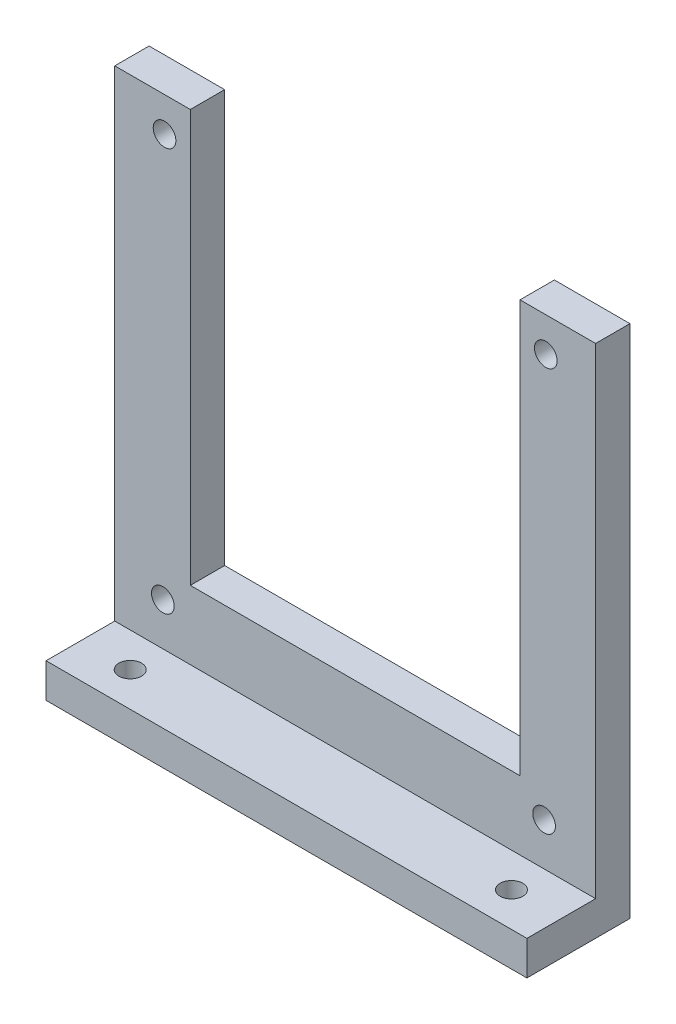
ISO-10303-21;
HEADER;
FILE_DESCRIPTION(('STEP AP214'),'2;1');
FILE_NAME('part.step','',(''),(''),'','','');
FILE_SCHEMA(('AUTOMOTIVE_DESIGN { 1 0 10303 214 1 1 1 1 }'));
ENDSEC;
DATA;
#1=APPLICATION_CONTEXT('core data for automotive mechanical design processes');
#2=APPLICATION_PROTOCOL_DEFINITION('international standard','automotive_design',2000,#1);
#3=PRODUCT_CONTEXT('',#1,'mechanical');
#4=PRODUCT('Part','Part','',(#3));
#5=PRODUCT_RELATED_PRODUCT_CATEGORY('part','',(#4));
#6=PRODUCT_DEFINITION_FORMATION('','',#4);
#7=PRODUCT_DEFINITION_CONTEXT('part definition',#1,'design');
#8=PRODUCT_DEFINITION('design','',#6,#7);
#9=PRODUCT_DEFINITION_SHAPE('','',#8);
#10=(LENGTH_UNIT() NAMED_UNIT(*) SI_UNIT(.MILLI.,.METRE.));
#11=(NAMED_UNIT(*) PLANE_ANGLE_UNIT() SI_UNIT($,.RADIAN.));
#12=(NAMED_UNIT(*) SI_UNIT($,.STERADIAN.) SOLID_ANGLE_UNIT());
#13=UNCERTAINTY_MEASURE_WITH_UNIT(LENGTH_MEASURE(1.E-05),#10,'distance_accuracy_value','');
#14=(GEOMETRIC_REPRESENTATION_CONTEXT(3) GLOBAL_UNCERTAINTY_ASSIGNED_CONTEXT((#13)) GLOBAL_UNIT_ASSIGNED_CONTEXT((#10,
#11,#12)) REPRESENTATION_CONTEXT('',''));
#15=CARTESIAN_POINT('',(0.,0.,0.));
#16=DIRECTION('',(0.,0.,1.));
#17=DIRECTION('',(1.,0.,0.));
#18=AXIS2_PLACEMENT_3D('',#15,#16,#17);
#19=CARTESIAN_POINT('',(-35.,0.,5.));
#20=DIRECTION('',(-1.,0.,0.));
#21=DIRECTION('',(0.,0.,1.));
#22=AXIS2_PLACEMENT_3D('',#19,#20,#21);
#23=PLANE('',#22);
#24=DIRECTION('',(0.,1.,0.));
#25=VECTOR('',#24,1.);
#26=CARTESIAN_POINT('',(-35.,0.,0.));
#27=LINE('',#26,#25);
#28=CARTESIAN_POINT('',(-35.,-7.50000000000001,0.));
#29=VERTEX_POINT('',#28);
#30=CARTESIAN_POINT('',(-35.,67.5,0.));
#31=VERTEX_POINT('',#30);
#32=EDGE_CURVE('E148',#29,#31,#27,.T.);
#33=ORIENTED_EDGE('',*,*,#32,.F.);
#34=DIRECTION('',(0.,0.,-1.));
#35=VECTOR('',#34,1.);
#36=CARTESIAN_POINT('',(-35.,-7.50000000000001,5.));
#37=LINE('',#36,#35);
#38=CARTESIAN_POINT('',(-35.,-7.50000000000001,15.));
#39=VERTEX_POINT('',#38);
#40=EDGE_CURVE('E11',#39,#29,#37,.T.);
#41=ORIENTED_EDGE('',*,*,#40,.F.);
#42=DIRECTION('',(0.,-1.,0.));
#43=VECTOR('',#42,1.);
#44=CARTESIAN_POINT('',(-35.,-7.50000000000001,15.));
#45=LINE('',#44,#43);
#46=CARTESIAN_POINT('',(-35.,-2.50000000000001,15.));
#47=VERTEX_POINT('',#46);
#48=EDGE_CURVE('E293',#47,#39,#45,.T.);
#49=ORIENTED_EDGE('',*,*,#48,.F.);
#50=DIRECTION('',(0.,0.,-1.));
#51=VECTOR('',#50,1.);
#52=CARTESIAN_POINT('',(-35.,-2.50000000000001,15.));
#53=LINE('',#52,#51);
#54=CARTESIAN_POINT('',(-35.,-2.50000000000001,5.));
#55=VERTEX_POINT('',#54);
#56=EDGE_CURVE('E223',#47,#55,#53,.T.);
#57=ORIENTED_EDGE('',*,*,#56,.T.);
#58=DIRECTION('',(0.,1.,0.));
#59=VECTOR('',#58,1.);
#60=CARTESIAN_POINT('',(-35.,0.,5.));
#61=LINE('',#60,#59);
#62=CARTESIAN_POINT('',(-35.,67.5,5.));
#63=VERTEX_POINT('',#62);
#64=EDGE_CURVE('E64',#55,#63,#61,.T.);
#65=ORIENTED_EDGE('',*,*,#64,.T.);
#66=DIRECTION('',(0.,0.,-1.));
#67=VECTOR('',#66,1.);
#68=CARTESIAN_POINT('',(-35.,67.5,5.));
#69=LINE('',#68,#67);
#70=EDGE_CURVE('E94',#63,#31,#69,.T.);
#71=ORIENTED_EDGE('',*,*,#70,.T.);
#72=EDGE_LOOP('',(#33,#41,#49,#57,#65,#71));
#73=FACE_BOUND('',#72,.T.);
#74=ADVANCED_FACE('F41',(#73),#23,.T.);
#75=CARTESIAN_POINT('',(0.,-7.5,5.));
#76=DIRECTION('',(0.,1.,0.));
#77=DIRECTION('',(-1.,0.,0.));
#78=AXIS2_PLACEMENT_3D('',#75,#76,#77);
#79=PLANE('',#78);
#80=CARTESIAN_POINT('',(-27.75,-7.50000000000001,10.));
#81=DIRECTION('',(0.,1.,0.));
#82=DIRECTION('',(-1.,0.,0.));
#83=AXIS2_PLACEMENT_3D('',#80,#81,#82);
#84=CIRCLE('',#83,1.65);
#85=CARTESIAN_POINT('',(-29.4,-7.50000000000001,10.));
#86=VERTEX_POINT('',#85);
#87=EDGE_CURVE('E302',#86,#86,#84,.T.);
#88=ORIENTED_EDGE('',*,*,#87,.T.);
#89=EDGE_LOOP('',(#88));
#90=FACE_BOUND('',#89,.T.);
#91=CARTESIAN_POINT('',(27.75,-7.5,10.));
#92=DIRECTION('',(0.,1.,0.));
#93=DIRECTION('',(-1.,0.,0.));
#94=AXIS2_PLACEMENT_3D('',#91,#92,#93);
#95=CIRCLE('',#94,1.65);
#96=CARTESIAN_POINT('',(26.1,-7.5,10.));
#97=VERTEX_POINT('',#96);
#98=EDGE_CURVE('E309',#97,#97,#95,.T.);
#99=ORIENTED_EDGE('',*,*,#98,.T.);
#100=EDGE_LOOP('',(#99));
#101=FACE_BOUND('',#100,.T.);
#102=DIRECTION('',(1.,0.,0.));
#103=VECTOR('',#102,1.);
#104=CARTESIAN_POINT('',(0.,-7.5,0.));
#105=LINE('',#104,#103);
#106=CARTESIAN_POINT('',(35.,-7.5,0.));
#107=VERTEX_POINT('',#106);
#108=EDGE_CURVE('E151',#29,#107,#105,.T.);
#109=ORIENTED_EDGE('',*,*,#108,.T.);
#110=DIRECTION('',(0.,0.,-1.));
#111=VECTOR('',#110,1.);
#112=CARTESIAN_POINT('',(35.,-7.5,5.));
#113=LINE('',#112,#111);
#114=CARTESIAN_POINT('',(35.,-7.50000000000001,15.));
#115=VERTEX_POINT('',#114);
#116=EDGE_CURVE('E49',#115,#107,#113,.T.);
#117=ORIENTED_EDGE('',*,*,#116,.F.);
#118=DIRECTION('',(1.,0.,0.));
#119=VECTOR('',#118,1.);
#120=CARTESIAN_POINT('',(-35.,-7.50000000000001,15.));
#121=LINE('',#120,#119);
#122=EDGE_CURVE('E297',#39,#115,#121,.T.);
#123=ORIENTED_EDGE('',*,*,#122,.F.);
#124=ORIENTED_EDGE('',*,*,#40,.T.);
#125=EDGE_LOOP('',(#109,#117,#123,#124));
#126=FACE_BOUND('',#125,.T.);
#127=ADVANCED_FACE('F278',(#90,#101,#126),#79,.F.);
#128=CARTESIAN_POINT('',(35.,0.,5.));
#129=DIRECTION('',(-1.,0.,0.));
#130=DIRECTION('',(0.,0.,1.));
#131=AXIS2_PLACEMENT_3D('',#128,#129,#130);
#132=PLANE('',#131);
#133=DIRECTION('',(0.,1.,0.));
#134=VECTOR('',#133,1.);
#135=CARTESIAN_POINT('',(35.,0.,0.));
#136=LINE('',#135,#134);
#137=CARTESIAN_POINT('',(35.,67.5,0.));
#138=VERTEX_POINT('',#137);
#139=EDGE_CURVE('E155',#107,#138,#136,.T.);
#140=ORIENTED_EDGE('',*,*,#139,.T.);
#141=DIRECTION('',(0.,0.,-1.));
#142=VECTOR('',#141,1.);
#143=CARTESIAN_POINT('',(35.,67.5,5.));
#144=LINE('',#143,#142);
#145=CARTESIAN_POINT('',(35.,67.5,5.));
#146=VERTEX_POINT('',#145);
#147=EDGE_CURVE('E184',#146,#138,#144,.T.);
#148=ORIENTED_EDGE('',*,*,#147,.F.);
#149=DIRECTION('',(0.,1.,0.));
#150=VECTOR('',#149,1.);
#151=CARTESIAN_POINT('',(35.,0.,5.));
#152=LINE('',#151,#150);
#153=CARTESIAN_POINT('',(35.,-2.50000000000001,5.));
#154=VERTEX_POINT('',#153);
#155=EDGE_CURVE('E99',#154,#146,#152,.T.);
#156=ORIENTED_EDGE('',*,*,#155,.F.);
#157=DIRECTION('',(0.,0.,-1.));
#158=VECTOR('',#157,1.);
#159=CARTESIAN_POINT('',(35.,-2.50000000000001,15.));
#160=LINE('',#159,#158);
#161=CARTESIAN_POINT('',(35.,-2.50000000000001,15.));
#162=VERTEX_POINT('',#161);
#163=EDGE_CURVE('E212',#162,#154,#160,.T.);
#164=ORIENTED_EDGE('',*,*,#163,.F.);
#165=DIRECTION('',(0.,1.,0.));
#166=VECTOR('',#165,1.);
#167=CARTESIAN_POINT('',(35.,-7.50000000000001,15.));
#168=LINE('',#167,#166);
#169=EDGE_CURVE('E197',#115,#162,#168,.T.);
#170=ORIENTED_EDGE('',*,*,#169,.F.);
#171=ORIENTED_EDGE('',*,*,#116,.T.);
#172=EDGE_LOOP('',(#140,#148,#156,#164,#170,#171));
#173=FACE_BOUND('',#172,.T.);
#174=ADVANCED_FACE('F193',(#173),#132,.F.);
#175=CARTESIAN_POINT('',(0.,67.5,5.));
#176=DIRECTION('',(0.,-1.,0.));
#177=DIRECTION('',(0.,0.,-1.));
#178=AXIS2_PLACEMENT_3D('',#175,#176,#177);
#179=PLANE('',#178);
#180=DIRECTION('',(-1.,0.,0.));
#181=VECTOR('',#180,1.);
#182=CARTESIAN_POINT('',(0.,67.5,0.));
#183=LINE('',#182,#181);
#184=CARTESIAN_POINT('',(24.,67.5,0.));
#185=VERTEX_POINT('',#184);
#186=EDGE_CURVE('E158',#138,#185,#183,.T.);
#187=ORIENTED_EDGE('',*,*,#186,.T.);
#188=DIRECTION('',(0.,0.,-1.));
#189=VECTOR('',#188,1.);
#190=CARTESIAN_POINT('',(24.,67.5,5.));
#191=LINE('',#190,#189);
#192=CARTESIAN_POINT('',(24.,67.5,5.));
#193=VERTEX_POINT('',#192);
#194=EDGE_CURVE('E181',#193,#185,#191,.T.);
#195=ORIENTED_EDGE('',*,*,#194,.F.);
#196=DIRECTION('',(-1.,0.,0.));
#197=VECTOR('',#196,1.);
#198=CARTESIAN_POINT('',(0.,67.5,5.));
#199=LINE('',#198,#197);
#200=EDGE_CURVE('E142',#146,#193,#199,.T.);
#201=ORIENTED_EDGE('',*,*,#200,.F.);
#202=ORIENTED_EDGE('',*,*,#147,.T.);
#203=EDGE_LOOP('',(#187,#195,#201,#202));
#204=FACE_BOUND('',#203,.T.);
#205=ADVANCED_FACE('F208',(#204),#179,.F.);
#206=CARTESIAN_POINT('',(24.,0.,5.));
#207=DIRECTION('',(-1.,0.,0.));
#208=DIRECTION('',(0.,0.,1.));
#209=AXIS2_PLACEMENT_3D('',#206,#207,#208);
#210=PLANE('',#209);
#211=DIRECTION('',(0.,1.,0.));
#212=VECTOR('',#211,1.);
#213=CARTESIAN_POINT('',(24.,0.,0.));
#214=LINE('',#213,#212);
#215=CARTESIAN_POINT('',(24.,7.5,0.));
#216=VERTEX_POINT('',#215);
#217=EDGE_CURVE('E162',#216,#185,#214,.T.);
#218=ORIENTED_EDGE('',*,*,#217,.F.);
#219=DIRECTION('',(0.,0.,-1.));
#220=VECTOR('',#219,1.);
#221=CARTESIAN_POINT('',(24.,7.5,5.));
#222=LINE('',#221,#220);
#223=CARTESIAN_POINT('',(24.,7.5,5.));
#224=VERTEX_POINT('',#223);
#225=EDGE_CURVE('E123',#224,#216,#222,.T.);
#226=ORIENTED_EDGE('',*,*,#225,.F.);
#227=DIRECTION('',(0.,1.,0.));
#228=VECTOR('',#227,1.);
#229=CARTESIAN_POINT('',(24.,0.,5.));
#230=LINE('',#229,#228);
#231=EDGE_CURVE('E138',#224,#193,#230,.T.);
#232=ORIENTED_EDGE('',*,*,#231,.T.);
#233=ORIENTED_EDGE('',*,*,#194,.T.);
#234=EDGE_LOOP('',(#218,#226,#232,#233));
#235=FACE_BOUND('',#234,.T.);
#236=ADVANCED_FACE('F407',(#235),#210,.T.);
#237=CARTESIAN_POINT('',(0.,7.5,5.));
#238=DIRECTION('',(0.,1.,0.));
#239=DIRECTION('',(0.,0.,1.));
#240=AXIS2_PLACEMENT_3D('',#237,#238,#239);
#241=PLANE('',#240);
#242=DIRECTION('',(1.,0.,0.));
#243=VECTOR('',#242,1.);
#244=CARTESIAN_POINT('',(0.,7.5,0.));
#245=LINE('',#244,#243);
#246=CARTESIAN_POINT('',(-24.,7.5,0.));
#247=VERTEX_POINT('',#246);
#248=EDGE_CURVE('E118',#247,#216,#245,.T.);
#249=ORIENTED_EDGE('',*,*,#248,.F.);
#250=DIRECTION('',(0.,0.,-1.));
#251=VECTOR('',#250,1.);
#252=CARTESIAN_POINT('',(-24.,7.5,5.));
#253=LINE('',#252,#251);
#254=CARTESIAN_POINT('',(-24.,7.5,5.));
#255=VERTEX_POINT('',#254);
#256=EDGE_CURVE('E112',#255,#247,#253,.T.);
#257=ORIENTED_EDGE('',*,*,#256,.F.);
#258=DIRECTION('',(1.,0.,0.));
#259=VECTOR('',#258,1.);
#260=CARTESIAN_POINT('',(0.,7.5,5.));
#261=LINE('',#260,#259);
#262=EDGE_CURVE('E116',#255,#224,#261,.T.);
#263=ORIENTED_EDGE('',*,*,#262,.T.);
#264=ORIENTED_EDGE('',*,*,#225,.T.);
#265=EDGE_LOOP('',(#249,#257,#263,#264));
#266=FACE_BOUND('',#265,.T.);
#267=ADVANCED_FACE('F114',(#266),#241,.T.);
#268=CARTESIAN_POINT('',(-24.,0.,5.));
#269=DIRECTION('',(-1.,0.,0.));
#270=DIRECTION('',(0.,0.,1.));
#271=AXIS2_PLACEMENT_3D('',#268,#269,#270);
#272=PLANE('',#271);
#273=DIRECTION('',(0.,1.,0.));
#274=VECTOR('',#273,1.);
#275=CARTESIAN_POINT('',(-24.,0.,0.));
#276=LINE('',#275,#274);
#277=CARTESIAN_POINT('',(-24.,67.5,0.));
#278=VERTEX_POINT('',#277);
#279=EDGE_CURVE('E168',#247,#278,#276,.T.);
#280=ORIENTED_EDGE('',*,*,#279,.T.);
#281=DIRECTION('',(0.,0.,-1.));
#282=VECTOR('',#281,1.);
#283=CARTESIAN_POINT('',(-24.,67.5,5.));
#284=LINE('',#283,#282);
#285=CARTESIAN_POINT('',(-24.,67.5,5.));
#286=VERTEX_POINT('',#285);
#287=EDGE_CURVE('E124',#286,#278,#284,.T.);
#288=ORIENTED_EDGE('',*,*,#287,.F.);
#289=DIRECTION('',(0.,1.,0.));
#290=VECTOR('',#289,1.);
#291=CARTESIAN_POINT('',(-24.,0.,5.));
#292=LINE('',#291,#290);
#293=EDGE_CURVE('E127',#255,#286,#292,.T.);
#294=ORIENTED_EDGE('',*,*,#293,.F.);
#295=ORIENTED_EDGE('',*,*,#256,.T.);
#296=EDGE_LOOP('',(#280,#288,#294,#295));
#297=FACE_BOUND('',#296,.T.);
#298=ADVANCED_FACE('F128',(#297),#272,.F.);
#299=CARTESIAN_POINT('',(0.,67.5,5.));
#300=DIRECTION('',(0.,1.,0.));
#301=DIRECTION('',(-1.,0.,0.));
#302=AXIS2_PLACEMENT_3D('',#299,#300,#301);
#303=PLANE('',#302);
#304=DIRECTION('',(1.,0.,0.));
#305=VECTOR('',#304,1.);
#306=CARTESIAN_POINT('',(0.,67.5,0.));
#307=LINE('',#306,#305);
#308=EDGE_CURVE('E171',#31,#278,#307,.T.);
#309=ORIENTED_EDGE('',*,*,#308,.F.);
#310=ORIENTED_EDGE('',*,*,#70,.F.);
#311=DIRECTION('',(1.,0.,0.));
#312=VECTOR('',#311,1.);
#313=CARTESIAN_POINT('',(0.,67.5,5.));
#314=LINE('',#313,#312);
#315=EDGE_CURVE('E132',#63,#286,#314,.T.);
#316=ORIENTED_EDGE('',*,*,#315,.T.);
#317=ORIENTED_EDGE('',*,*,#287,.T.);
#318=EDGE_LOOP('',(#309,#310,#316,#317));
#319=FACE_BOUND('',#318,.T.);
#320=ADVANCED_FACE('F266',(#319),#303,.T.);
#321=CARTESIAN_POINT('',(0.,0.,5.));
#322=DIRECTION('',(0.,0.,1.));
#323=DIRECTION('',(1.,0.,0.));
#324=AXIS2_PLACEMENT_3D('',#321,#322,#323);
#325=PLANE('',#324);
#326=DIRECTION('',(-1.,0.,0.));
#327=VECTOR('',#326,1.);
#328=CARTESIAN_POINT('',(-35.,-2.50000000000001,5.));
#329=LINE('',#328,#327);
#330=EDGE_CURVE('E56',#154,#55,#329,.T.);
#331=ORIENTED_EDGE('',*,*,#330,.F.);
#332=ORIENTED_EDGE('',*,*,#155,.T.);
#333=ORIENTED_EDGE('',*,*,#200,.T.);
#334=ORIENTED_EDGE('',*,*,#231,.F.);
#335=ORIENTED_EDGE('',*,*,#262,.F.);
#336=ORIENTED_EDGE('',*,*,#293,.T.);
#337=ORIENTED_EDGE('',*,*,#315,.F.);
#338=ORIENTED_EDGE('',*,*,#64,.F.);
#339=EDGE_LOOP('',(#331,#332,#333,#334,#335,#336,#337,#338));
#340=FACE_BOUND('',#339,.T.);
#341=CARTESIAN_POINT('',(-27.75,62.5,5.));
#342=DIRECTION('',(0.,0.,1.));
#343=DIRECTION('',(1.,0.,0.));
#344=AXIS2_PLACEMENT_3D('',#341,#342,#343);
#345=CIRCLE('',#344,1.65);
#346=CARTESIAN_POINT('',(-26.1,62.5,5.));
#347=VERTEX_POINT('',#346);
#348=EDGE_CURVE('E222',#347,#347,#345,.T.);
#349=ORIENTED_EDGE('',*,*,#348,.F.);
#350=EDGE_LOOP('',(#349));
#351=FACE_BOUND('',#350,.T.);
#352=CARTESIAN_POINT('',(27.75,62.5,5.));
#353=DIRECTION('',(0.,0.,1.));
#354=DIRECTION('',(1.,0.,0.));
#355=AXIS2_PLACEMENT_3D('',#352,#353,#354);
#356=CIRCLE('',#355,1.65);
#357=CARTESIAN_POINT('',(29.4,62.5,5.));
#358=VERTEX_POINT('',#357);
#359=EDGE_CURVE('E246',#358,#358,#356,.T.);
#360=ORIENTED_EDGE('',*,*,#359,.F.);
#361=EDGE_LOOP('',(#360));
#362=FACE_BOUND('',#361,.T.);
#363=CARTESIAN_POINT('',(27.502156905522,3.70052233394824,5.));
#364=DIRECTION('',(0.,0.,1.));
#365=DIRECTION('',(1.,0.,0.));
#366=AXIS2_PLACEMENT_3D('',#363,#364,#365);
#367=CIRCLE('',#366,1.65);
#368=CARTESIAN_POINT('',(29.152156905522,3.70052233394824,5.));
#369=VERTEX_POINT('',#368);
#370=EDGE_CURVE('E238',#369,#369,#367,.T.);
#371=ORIENTED_EDGE('',*,*,#370,.F.);
#372=EDGE_LOOP('',(#371));
#373=FACE_BOUND('',#372,.T.);
#374=CARTESIAN_POINT('',(-27.997843094478,3.70052233394823,5.));
#375=DIRECTION('',(0.,0.,1.));
#376=DIRECTION('',(1.,0.,0.));
#377=AXIS2_PLACEMENT_3D('',#374,#375,#376);
#378=CIRCLE('',#377,1.65);
#379=CARTESIAN_POINT('',(-26.347843094478,3.70052233394823,5.));
#380=VERTEX_POINT('',#379);
#381=EDGE_CURVE('E237',#380,#380,#378,.T.);
#382=ORIENTED_EDGE('',*,*,#381,.F.);
#383=EDGE_LOOP('',(#382));
#384=FACE_BOUND('',#383,.T.);
#385=ADVANCED_FACE('F135',(#340,#351,#362,#373,#384),#325,.T.);
#386=CARTESIAN_POINT('',(0.,0.,0.));
#387=DIRECTION('',(0.,0.,1.));
#388=DIRECTION('',(1.,0.,0.));
#389=AXIS2_PLACEMENT_3D('',#386,#387,#388);
#390=PLANE('',#389);
#391=CARTESIAN_POINT('',(-27.75,62.5,0.));
#392=DIRECTION('',(0.,0.,1.));
#393=DIRECTION('',(1.,0.,0.));
#394=AXIS2_PLACEMENT_3D('',#391,#392,#393);
#395=CIRCLE('',#394,1.65);
#396=CARTESIAN_POINT('',(-26.1,62.5,0.));
#397=VERTEX_POINT('',#396);
#398=EDGE_CURVE('E228',#397,#397,#395,.T.);
#399=ORIENTED_EDGE('',*,*,#398,.T.);
#400=EDGE_LOOP('',(#399));
#401=FACE_BOUND('',#400,.T.);
#402=CARTESIAN_POINT('',(27.75,62.5,0.));
#403=DIRECTION('',(0.,0.,1.));
#404=DIRECTION('',(1.,0.,0.));
#405=AXIS2_PLACEMENT_3D('',#402,#403,#404);
#406=CIRCLE('',#405,1.65);
#407=CARTESIAN_POINT('',(29.4,62.5,0.));
#408=VERTEX_POINT('',#407);
#409=EDGE_CURVE('E242',#408,#408,#406,.T.);
#410=ORIENTED_EDGE('',*,*,#409,.T.);
#411=EDGE_LOOP('',(#410));
#412=FACE_BOUND('',#411,.T.);
#413=CARTESIAN_POINT('',(27.502156905522,3.70052233394824,0.));
#414=DIRECTION('',(0.,0.,1.));
#415=DIRECTION('',(1.,0.,0.));
#416=AXIS2_PLACEMENT_3D('',#413,#414,#415);
#417=CIRCLE('',#416,1.65);
#418=CARTESIAN_POINT('',(29.152156905522,3.70052233394824,0.));
#419=VERTEX_POINT('',#418);
#420=EDGE_CURVE('E233',#419,#419,#417,.T.);
#421=ORIENTED_EDGE('',*,*,#420,.T.);
#422=EDGE_LOOP('',(#421));
#423=FACE_BOUND('',#422,.T.);
#424=CARTESIAN_POINT('',(-27.997843094478,3.70052233394823,0.));
#425=DIRECTION('',(0.,0.,1.));
#426=DIRECTION('',(1.,0.,0.));
#427=AXIS2_PLACEMENT_3D('',#424,#425,#426);
#428=CIRCLE('',#427,1.65);
#429=CARTESIAN_POINT('',(-26.347843094478,3.70052233394823,0.));
#430=VERTEX_POINT('',#429);
#431=EDGE_CURVE('E152',#430,#430,#428,.T.);
#432=ORIENTED_EDGE('',*,*,#431,.T.);
#433=EDGE_LOOP('',(#432));
#434=FACE_BOUND('',#433,.T.);
#435=ORIENTED_EDGE('',*,*,#32,.T.);
#436=ORIENTED_EDGE('',*,*,#308,.T.);
#437=ORIENTED_EDGE('',*,*,#279,.F.);
#438=ORIENTED_EDGE('',*,*,#248,.T.);
#439=ORIENTED_EDGE('',*,*,#217,.T.);
#440=ORIENTED_EDGE('',*,*,#186,.F.);
#441=ORIENTED_EDGE('',*,*,#139,.F.);
#442=ORIENTED_EDGE('',*,*,#108,.F.);
#443=EDGE_LOOP('',(#435,#436,#437,#438,#439,#440,#441,#442));
#444=FACE_BOUND('',#443,.T.);
#445=ADVANCED_FACE('F204',(#401,#412,#423,#434,#444),#390,.F.);
#446=CARTESIAN_POINT('',(-27.997843094478,3.70052233394823,0.));
#447=DIRECTION('',(0.,0.,1.));
#448=DIRECTION('',(1.,0.,0.));
#449=AXIS2_PLACEMENT_3D('',#446,#447,#448);
#450=CYLINDRICAL_SURFACE('',#449,1.65);
#451=ORIENTED_EDGE('',*,*,#431,.F.);
#452=EDGE_LOOP('',(#451));
#453=FACE_BOUND('',#452,.T.);
#454=ORIENTED_EDGE('',*,*,#381,.T.);
#455=EDGE_LOOP('',(#454));
#456=FACE_BOUND('',#455,.T.);
#457=ADVANCED_FACE('F263',(#453,#456),#450,.F.);
#458=CARTESIAN_POINT('',(27.502156905522,3.70052233394824,0.));
#459=DIRECTION('',(0.,0.,1.));
#460=DIRECTION('',(1.,0.,0.));
#461=AXIS2_PLACEMENT_3D('',#458,#459,#460);
#462=CYLINDRICAL_SURFACE('',#461,1.65);
#463=ORIENTED_EDGE('',*,*,#420,.F.);
#464=EDGE_LOOP('',(#463));
#465=FACE_BOUND('',#464,.T.);
#466=ORIENTED_EDGE('',*,*,#370,.T.);
#467=EDGE_LOOP('',(#466));
#468=FACE_BOUND('',#467,.T.);
#469=ADVANCED_FACE('F344',(#465,#468),#462,.F.);
#470=CARTESIAN_POINT('',(27.75,62.5,0.));
#471=DIRECTION('',(0.,0.,1.));
#472=DIRECTION('',(1.,0.,0.));
#473=AXIS2_PLACEMENT_3D('',#470,#471,#472);
#474=CYLINDRICAL_SURFACE('',#473,1.65);
#475=ORIENTED_EDGE('',*,*,#409,.F.);
#476=EDGE_LOOP('',(#475));
#477=FACE_BOUND('',#476,.T.);
#478=ORIENTED_EDGE('',*,*,#359,.T.);
#479=EDGE_LOOP('',(#478));
#480=FACE_BOUND('',#479,.T.);
#481=ADVANCED_FACE('F347',(#477,#480),#474,.F.);
#482=CARTESIAN_POINT('',(-27.75,62.5,0.));
#483=DIRECTION('',(0.,0.,1.));
#484=DIRECTION('',(1.,0.,0.));
#485=AXIS2_PLACEMENT_3D('',#482,#483,#484);
#486=CYLINDRICAL_SURFACE('',#485,1.65);
#487=ORIENTED_EDGE('',*,*,#398,.F.);
#488=EDGE_LOOP('',(#487));
#489=FACE_BOUND('',#488,.T.);
#490=ORIENTED_EDGE('',*,*,#348,.T.);
#491=EDGE_LOOP('',(#490));
#492=FACE_BOUND('',#491,.T.);
#493=ADVANCED_FACE('F327',(#489,#492),#486,.F.);
#494=CARTESIAN_POINT('',(-35.,-2.50000000000001,15.));
#495=DIRECTION('',(0.,-1.,0.));
#496=DIRECTION('',(0.,0.,-1.));
#497=AXIS2_PLACEMENT_3D('',#494,#495,#496);
#498=PLANE('',#497);
#499=CARTESIAN_POINT('',(-27.75,-2.50000000000001,10.));
#500=DIRECTION('',(0.,1.,0.));
#501=DIRECTION('',(0.,0.,1.));
#502=AXIS2_PLACEMENT_3D('',#499,#500,#501);
#503=CIRCLE('',#502,1.65);
#504=CARTESIAN_POINT('',(-27.75,-2.50000000000001,11.65));
#505=VERTEX_POINT('',#504);
#506=EDGE_CURVE('E313',#505,#505,#503,.T.);
#507=ORIENTED_EDGE('',*,*,#506,.F.);
#508=EDGE_LOOP('',(#507));
#509=FACE_BOUND('',#508,.T.);
#510=CARTESIAN_POINT('',(27.75,-2.50000000000001,10.));
#511=DIRECTION('',(0.,1.,0.));
#512=DIRECTION('',(0.,0.,1.));
#513=AXIS2_PLACEMENT_3D('',#510,#511,#512);
#514=CIRCLE('',#513,1.65);
#515=CARTESIAN_POINT('',(27.75,-2.50000000000001,11.65));
#516=VERTEX_POINT('',#515);
#517=EDGE_CURVE('E314',#516,#516,#514,.T.);
#518=ORIENTED_EDGE('',*,*,#517,.F.);
#519=EDGE_LOOP('',(#518));
#520=FACE_BOUND('',#519,.T.);
#521=ORIENTED_EDGE('',*,*,#330,.T.);
#522=ORIENTED_EDGE('',*,*,#56,.F.);
#523=DIRECTION('',(-1.,0.,0.));
#524=VECTOR('',#523,1.);
#525=CARTESIAN_POINT('',(-35.,-2.50000000000001,15.));
#526=LINE('',#525,#524);
#527=EDGE_CURVE('E220',#162,#47,#526,.T.);
#528=ORIENTED_EDGE('',*,*,#527,.F.);
#529=ORIENTED_EDGE('',*,*,#163,.T.);
#530=EDGE_LOOP('',(#521,#522,#528,#529));
#531=FACE_BOUND('',#530,.T.);
#532=ADVANCED_FACE('F217',(#509,#520,#531),#498,.F.);
#533=CARTESIAN_POINT('',(0.,0.,15.));
#534=DIRECTION('',(0.,0.,-1.));
#535=DIRECTION('',(-1.,0.,0.));
#536=AXIS2_PLACEMENT_3D('',#533,#534,#535);
#537=PLANE('',#536);
#538=ORIENTED_EDGE('',*,*,#48,.T.);
#539=ORIENTED_EDGE('',*,*,#122,.T.);
#540=ORIENTED_EDGE('',*,*,#169,.T.);
#541=ORIENTED_EDGE('',*,*,#527,.T.);
#542=EDGE_LOOP('',(#538,#539,#540,#541));
#543=FACE_BOUND('',#542,.T.);
#544=ADVANCED_FACE('F292',(#543),#537,.F.);
#545=CARTESIAN_POINT('',(27.75,-12.5,10.));
#546=DIRECTION('',(0.,1.,0.));
#547=DIRECTION('',(0.,0.,1.));
#548=AXIS2_PLACEMENT_3D('',#545,#546,#547);
#549=CYLINDRICAL_SURFACE('',#548,1.65);
#550=ORIENTED_EDGE('',*,*,#517,.T.);
#551=EDGE_LOOP('',(#550));
#552=FACE_BOUND('',#551,.T.);
#553=ORIENTED_EDGE('',*,*,#98,.F.);
#554=EDGE_LOOP('',(#553));
#555=FACE_BOUND('',#554,.T.);
#556=ADVANCED_FACE('F331',(#552,#555),#549,.F.);
#557=CARTESIAN_POINT('',(-27.75,-12.5,10.));
#558=DIRECTION('',(0.,1.,0.));
#559=DIRECTION('',(0.,0.,1.));
#560=AXIS2_PLACEMENT_3D('',#557,#558,#559);
#561=CYLINDRICAL_SURFACE('',#560,1.65);
#562=ORIENTED_EDGE('',*,*,#506,.T.);
#563=EDGE_LOOP('',(#562));
#564=FACE_BOUND('',#563,.T.);
#565=ORIENTED_EDGE('',*,*,#87,.F.);
#566=EDGE_LOOP('',(#565));
#567=FACE_BOUND('',#566,.T.);
#568=ADVANCED_FACE('F322',(#564,#567),#561,.F.);
#569=CLOSED_SHELL('',(#74,#127,#174,#205,#236,#267,#298,#320,#385,#445,#457,#469,#481,#493,#532,
#544,#556,#568));
#570=MANIFOLD_SOLID_BREP('B2',#569);
#571=ADVANCED_BREP_SHAPE_REPRESENTATION('',(#18,#570),#14);
#572=SHAPE_DEFINITION_REPRESENTATION(#9,#571);
ENDSEC;
END-ISO-10303-21;
